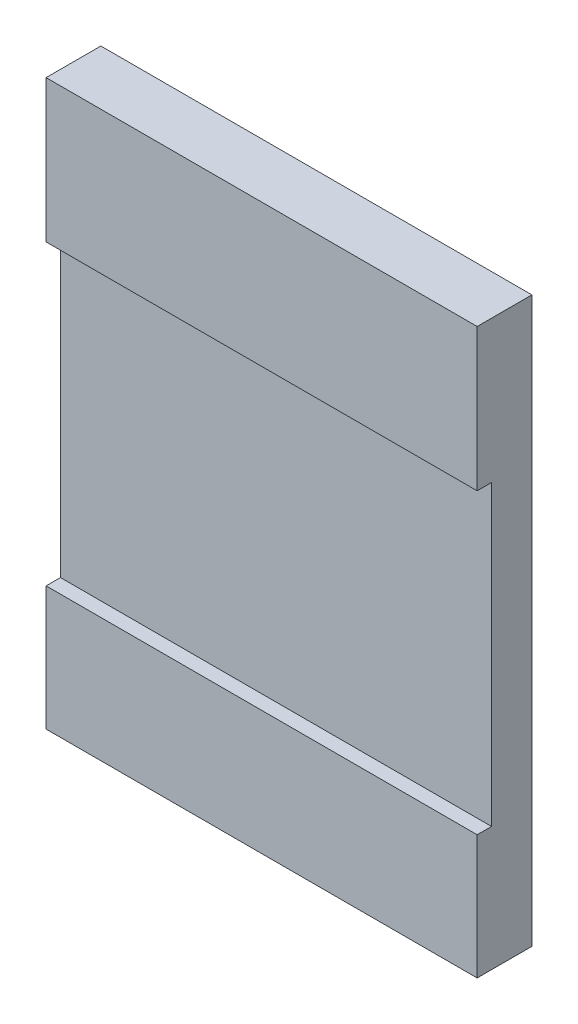
ISO-10303-21;
HEADER;
FILE_DESCRIPTION(('STEP AP214'),'2;1');
FILE_NAME('part.step','',(''),(''),'','','');
FILE_SCHEMA(('AUTOMOTIVE_DESIGN { 1 0 10303 214 1 1 1 1 }'));
ENDSEC;
DATA;
#1=APPLICATION_CONTEXT('core data for automotive mechanical design processes');
#2=APPLICATION_PROTOCOL_DEFINITION('international standard','automotive_design',2000,#1);
#3=PRODUCT_CONTEXT('',#1,'mechanical');
#4=PRODUCT('Part','Part','',(#3));
#5=PRODUCT_RELATED_PRODUCT_CATEGORY('part','',(#4));
#6=PRODUCT_DEFINITION_FORMATION('','',#4);
#7=PRODUCT_DEFINITION_CONTEXT('part definition',#1,'design');
#8=PRODUCT_DEFINITION('design','',#6,#7);
#9=PRODUCT_DEFINITION_SHAPE('','',#8);
#10=(LENGTH_UNIT() NAMED_UNIT(*) SI_UNIT(.MILLI.,.METRE.));
#11=(NAMED_UNIT(*) PLANE_ANGLE_UNIT() SI_UNIT($,.RADIAN.));
#12=(NAMED_UNIT(*) SI_UNIT($,.STERADIAN.) SOLID_ANGLE_UNIT());
#13=UNCERTAINTY_MEASURE_WITH_UNIT(LENGTH_MEASURE(1.E-05),#10,'distance_accuracy_value','');
#14=(GEOMETRIC_REPRESENTATION_CONTEXT(3) GLOBAL_UNCERTAINTY_ASSIGNED_CONTEXT((#13)) GLOBAL_UNIT_ASSIGNED_CONTEXT((#10,
#11,#12)) REPRESENTATION_CONTEXT('',''));
#15=CARTESIAN_POINT('',(0.,0.,0.));
#16=DIRECTION('',(0.,0.,1.));
#17=DIRECTION('',(1.,0.,0.));
#18=AXIS2_PLACEMENT_3D('',#15,#16,#17);
#19=CARTESIAN_POINT('',(0.,3.17500000000001,0.));
#20=DIRECTION('',(0.,0.,1.));
#21=DIRECTION('',(1.,0.,0.));
#22=AXIS2_PLACEMENT_3D('',#19,#20,#21);
#23=PLANE('',#22);
#24=DIRECTION('',(1.,0.,0.));
#25=VECTOR('',#24,1.);
#26=CARTESIAN_POINT('',(-75.001,51.8249999999998,0.));
#27=LINE('',#26,#25);
#28=CARTESIAN_POINT('',(-75.,51.8249999999998,0.));
#29=VERTEX_POINT('',#28);
#30=CARTESIAN_POINT('',(75.,51.8249999999999,0.));
#31=VERTEX_POINT('',#30);
#32=EDGE_CURVE('E109',#29,#31,#27,.T.);
#33=ORIENTED_EDGE('',*,*,#32,.T.);
#34=DIRECTION('',(0.,1.,0.));
#35=VECTOR('',#34,1.);
#36=CARTESIAN_POINT('',(75.0000000000001,3.17500000000001,0.));
#37=LINE('',#36,#35);
#38=CARTESIAN_POINT('',(75.,101.35,0.));
#39=VERTEX_POINT('',#38);
#40=EDGE_CURVE('E57',#31,#39,#37,.T.);
#41=ORIENTED_EDGE('',*,*,#40,.T.);
#42=DIRECTION('',(1.,0.,0.));
#43=VECTOR('',#42,1.);
#44=CARTESIAN_POINT('',(0.,101.35,0.));
#45=LINE('',#44,#43);
#46=CARTESIAN_POINT('',(-75.,101.35,0.));
#47=VERTEX_POINT('',#46);
#48=EDGE_CURVE('E11',#39,#47,#45,.F.);
#49=ORIENTED_EDGE('',*,*,#48,.T.);
#50=DIRECTION('',(0.,1.,0.));
#51=VECTOR('',#50,1.);
#52=CARTESIAN_POINT('',(-75.,3.17500000000001,0.));
#53=LINE('',#52,#51);
#54=EDGE_CURVE('E117',#47,#29,#53,.F.);
#55=ORIENTED_EDGE('',*,*,#54,.T.);
#56=EDGE_LOOP('',(#33,#41,#49,#55));
#57=FACE_BOUND('',#56,.T.);
#58=ADVANCED_FACE('F32',(#57),#23,.T.);
#59=CARTESIAN_POINT('',(0.,3.17500000000001,-19.05));
#60=DIRECTION('',(0.,0.,-1.));
#61=DIRECTION('',(-1.,0.,0.));
#62=AXIS2_PLACEMENT_3D('',#59,#60,#61);
#63=PLANE('',#62);
#64=DIRECTION('',(0.,1.,0.));
#65=VECTOR('',#64,1.);
#66=CARTESIAN_POINT('',(75.,101.35,-19.05));
#67=LINE('',#66,#65);
#68=CARTESIAN_POINT('',(75.0000000000001,-94.9999999999998,-19.05));
#69=VERTEX_POINT('',#68);
#70=CARTESIAN_POINT('',(75.,101.35,-19.05));
#71=VERTEX_POINT('',#70);
#72=EDGE_CURVE('E137',#69,#71,#67,.T.);
#73=ORIENTED_EDGE('',*,*,#72,.F.);
#74=DIRECTION('',(1.,0.,0.));
#75=VECTOR('',#74,1.);
#76=CARTESIAN_POINT('',(75.0000000000001,-94.9999999999998,-19.05));
#77=LINE('',#76,#75);
#78=CARTESIAN_POINT('',(-75.,-94.9999999999998,-19.05));
#79=VERTEX_POINT('',#78);
#80=EDGE_CURVE('E142',#79,#69,#77,.T.);
#81=ORIENTED_EDGE('',*,*,#80,.F.);
#82=DIRECTION('',(0.,1.,0.));
#83=VECTOR('',#82,1.);
#84=CARTESIAN_POINT('',(-75.,-94.9999999999998,-19.05));
#85=LINE('',#84,#83);
#86=CARTESIAN_POINT('',(-75.,101.35,-19.05));
#87=VERTEX_POINT('',#86);
#88=EDGE_CURVE('E36',#87,#79,#85,.F.);
#89=ORIENTED_EDGE('',*,*,#88,.F.);
#90=DIRECTION('',(1.,0.,0.));
#91=VECTOR('',#90,1.);
#92=CARTESIAN_POINT('',(-75.,101.35,-19.05));
#93=LINE('',#92,#91);
#94=EDGE_CURVE('E131',#71,#87,#93,.F.);
#95=ORIENTED_EDGE('',*,*,#94,.F.);
#96=EDGE_LOOP('',(#73,#81,#89,#95));
#97=FACE_BOUND('',#96,.T.);
#98=ADVANCED_FACE('F34',(#97),#63,.T.);
#99=CARTESIAN_POINT('',(-75.,-94.9999999999998,0.));
#100=DIRECTION('',(-1.,0.,0.));
#101=DIRECTION('',(0.,0.,1.));
#102=AXIS2_PLACEMENT_3D('',#99,#100,#101);
#103=PLANE('',#102);
#104=DIRECTION('',(0.,0.,1.));
#105=VECTOR('',#104,1.);
#106=CARTESIAN_POINT('',(-75.,51.8249999999998,0.));
#107=LINE('',#106,#105);
#108=CARTESIAN_POINT('',(-75.,51.8249999999999,-5.));
#109=VERTEX_POINT('',#108);
#110=EDGE_CURVE('E112',#109,#29,#107,.T.);
#111=ORIENTED_EDGE('',*,*,#110,.T.);
#112=ORIENTED_EDGE('',*,*,#54,.F.);
#113=DIRECTION('',(0.,0.,1.));
#114=VECTOR('',#113,1.);
#115=CARTESIAN_POINT('',(-75.,101.35,0.));
#116=LINE('',#115,#114);
#117=EDGE_CURVE('E127',#87,#47,#116,.T.);
#118=ORIENTED_EDGE('',*,*,#117,.F.);
#119=ORIENTED_EDGE('',*,*,#88,.T.);
#120=DIRECTION('',(0.,0.,-1.));
#121=VECTOR('',#120,1.);
#122=CARTESIAN_POINT('',(-75.,-94.9999999999998,0.));
#123=LINE('',#122,#121);
#124=CARTESIAN_POINT('',(-75.,-94.9999999999998,0.));
#125=VERTEX_POINT('',#124);
#126=EDGE_CURVE('E143',#125,#79,#123,.T.);
#127=ORIENTED_EDGE('',*,*,#126,.F.);
#128=CARTESIAN_POINT('',(-75.,-51.8249999999998,0.));
#129=VERTEX_POINT('',#128);
#130=EDGE_CURVE('E123',#129,#125,#53,.F.);
#131=ORIENTED_EDGE('',*,*,#130,.F.);
#132=DIRECTION('',(0.,0.,-1.));
#133=VECTOR('',#132,1.);
#134=CARTESIAN_POINT('',(-75.,-51.8249999999998,0.));
#135=LINE('',#134,#133);
#136=CARTESIAN_POINT('',(-75.,-51.8249999999998,-5.));
#137=VERTEX_POINT('',#136);
#138=EDGE_CURVE('E49',#129,#137,#135,.T.);
#139=ORIENTED_EDGE('',*,*,#138,.T.);
#140=DIRECTION('',(0.,1.,0.));
#141=VECTOR('',#140,1.);
#142=CARTESIAN_POINT('',(-75.,-51.8249999999998,-5.));
#143=LINE('',#142,#141);
#144=EDGE_CURVE('E91',#137,#109,#143,.T.);
#145=ORIENTED_EDGE('',*,*,#144,.T.);
#146=EDGE_LOOP('',(#111,#112,#118,#119,#127,#131,#139,#145));
#147=FACE_BOUND('',#146,.T.);
#148=ADVANCED_FACE('F116',(#147),#103,.T.);
#149=CARTESIAN_POINT('',(75.0000000000001,-94.9999999999998,0.));
#150=DIRECTION('',(0.,-1.,0.));
#151=DIRECTION('',(0.,0.,-1.));
#152=AXIS2_PLACEMENT_3D('',#149,#150,#151);
#153=PLANE('',#152);
#154=ORIENTED_EDGE('',*,*,#80,.T.);
#155=DIRECTION('',(0.,0.,1.));
#156=VECTOR('',#155,1.);
#157=CARTESIAN_POINT('',(75.,-94.9999999999998,0.));
#158=LINE('',#157,#156);
#159=CARTESIAN_POINT('',(75.0000000000001,-94.9999999999998,0.));
#160=VERTEX_POINT('',#159);
#161=EDGE_CURVE('E139',#160,#69,#158,.F.);
#162=ORIENTED_EDGE('',*,*,#161,.F.);
#163=DIRECTION('',(1.,0.,0.));
#164=VECTOR('',#163,1.);
#165=CARTESIAN_POINT('',(0.,-94.9999999999998,0.));
#166=LINE('',#165,#164);
#167=EDGE_CURVE('E122',#125,#160,#166,.T.);
#168=ORIENTED_EDGE('',*,*,#167,.F.);
#169=ORIENTED_EDGE('',*,*,#126,.T.);
#170=EDGE_LOOP('',(#154,#162,#168,#169));
#171=FACE_BOUND('',#170,.T.);
#172=ADVANCED_FACE('F199',(#171),#153,.T.);
#173=CARTESIAN_POINT('',(75.,101.35,0.));
#174=DIRECTION('',(1.,0.,0.));
#175=DIRECTION('',(0.,1.,0.));
#176=AXIS2_PLACEMENT_3D('',#173,#174,#175);
#177=PLANE('',#176);
#178=DIRECTION('',(0.,0.,1.));
#179=VECTOR('',#178,1.);
#180=CARTESIAN_POINT('',(75.,51.8249999999999,0.));
#181=LINE('',#180,#179);
#182=CARTESIAN_POINT('',(75.,51.8249999999999,-5.));
#183=VERTEX_POINT('',#182);
#184=EDGE_CURVE('E98',#183,#31,#181,.T.);
#185=ORIENTED_EDGE('',*,*,#184,.F.);
#186=DIRECTION('',(0.,1.,0.));
#187=VECTOR('',#186,1.);
#188=CARTESIAN_POINT('',(75.,-51.8249999999998,-5.));
#189=LINE('',#188,#187);
#190=CARTESIAN_POINT('',(75.,-51.8249999999998,-5.));
#191=VERTEX_POINT('',#190);
#192=EDGE_CURVE('E162',#191,#183,#189,.T.);
#193=ORIENTED_EDGE('',*,*,#192,.F.);
#194=DIRECTION('',(0.,0.,-1.));
#195=VECTOR('',#194,1.);
#196=CARTESIAN_POINT('',(75.,-51.8249999999998,0.));
#197=LINE('',#196,#195);
#198=CARTESIAN_POINT('',(75.,-51.8249999999998,0.));
#199=VERTEX_POINT('',#198);
#200=EDGE_CURVE('E119',#199,#191,#197,.T.);
#201=ORIENTED_EDGE('',*,*,#200,.F.);
#202=EDGE_CURVE('E41',#160,#199,#37,.T.);
#203=ORIENTED_EDGE('',*,*,#202,.F.);
#204=ORIENTED_EDGE('',*,*,#161,.T.);
#205=ORIENTED_EDGE('',*,*,#72,.T.);
#206=DIRECTION('',(0.,0.,1.));
#207=VECTOR('',#206,1.);
#208=CARTESIAN_POINT('',(75.,101.35,0.));
#209=LINE('',#208,#207);
#210=EDGE_CURVE('E134',#39,#71,#209,.F.);
#211=ORIENTED_EDGE('',*,*,#210,.F.);
#212=ORIENTED_EDGE('',*,*,#40,.F.);
#213=EDGE_LOOP('',(#185,#193,#201,#203,#204,#205,#211,#212));
#214=FACE_BOUND('',#213,.T.);
#215=ADVANCED_FACE('F158',(#214),#177,.T.);
#216=CARTESIAN_POINT('',(-75.,101.35,0.));
#217=DIRECTION('',(0.,1.,0.));
#218=DIRECTION('',(0.,0.,1.));
#219=AXIS2_PLACEMENT_3D('',#216,#217,#218);
#220=PLANE('',#219);
#221=ORIENTED_EDGE('',*,*,#94,.T.);
#222=ORIENTED_EDGE('',*,*,#117,.T.);
#223=ORIENTED_EDGE('',*,*,#48,.F.);
#224=ORIENTED_EDGE('',*,*,#210,.T.);
#225=EDGE_LOOP('',(#221,#222,#223,#224));
#226=FACE_BOUND('',#225,.T.);
#227=ADVANCED_FACE('F187',(#226),#220,.T.);
#228=DIRECTION('',(1.,0.,0.));
#229=VECTOR('',#228,1.);
#230=CARTESIAN_POINT('',(-75.001,-51.8249999999998,0.));
#231=LINE('',#230,#229);
#232=EDGE_CURVE('E150',#129,#199,#231,.T.);
#233=ORIENTED_EDGE('',*,*,#232,.F.);
#234=ORIENTED_EDGE('',*,*,#130,.T.);
#235=ORIENTED_EDGE('',*,*,#167,.T.);
#236=ORIENTED_EDGE('',*,*,#202,.T.);
#237=EDGE_LOOP('',(#233,#234,#235,#236));
#238=FACE_BOUND('',#237,.T.);
#239=ADVANCED_FACE('F155',(#238),#23,.T.);
#240=CARTESIAN_POINT('',(-75.001,51.8249999999998,0.));
#241=DIRECTION('',(0.,1.,0.));
#242=DIRECTION('',(-1.,0.,0.));
#243=AXIS2_PLACEMENT_3D('',#240,#241,#242);
#244=PLANE('',#243);
#245=DIRECTION('',(1.,0.,0.));
#246=VECTOR('',#245,1.);
#247=CARTESIAN_POINT('',(-75.001,51.8249999999998,-5.));
#248=LINE('',#247,#246);
#249=EDGE_CURVE('E114',#109,#183,#248,.T.);
#250=ORIENTED_EDGE('',*,*,#249,.T.);
#251=ORIENTED_EDGE('',*,*,#184,.T.);
#252=ORIENTED_EDGE('',*,*,#32,.F.);
#253=ORIENTED_EDGE('',*,*,#110,.F.);
#254=EDGE_LOOP('',(#250,#251,#252,#253));
#255=FACE_BOUND('',#254,.T.);
#256=ADVANCED_FACE('F111',(#255),#244,.F.);
#257=CARTESIAN_POINT('',(-75.001,-51.8249999999998,-5.));
#258=DIRECTION('',(0.,0.,-1.));
#259=DIRECTION('',(-1.,0.,0.));
#260=AXIS2_PLACEMENT_3D('',#257,#258,#259);
#261=PLANE('',#260);
#262=DIRECTION('',(1.,0.,0.));
#263=VECTOR('',#262,1.);
#264=CARTESIAN_POINT('',(-75.001,-51.8249999999998,-5.));
#265=LINE('',#264,#263);
#266=EDGE_CURVE('E168',#137,#191,#265,.T.);
#267=ORIENTED_EDGE('',*,*,#266,.T.);
#268=ORIENTED_EDGE('',*,*,#192,.T.);
#269=ORIENTED_EDGE('',*,*,#249,.F.);
#270=ORIENTED_EDGE('',*,*,#144,.F.);
#271=EDGE_LOOP('',(#267,#268,#269,#270));
#272=FACE_BOUND('',#271,.T.);
#273=ADVANCED_FACE('F171',(#272),#261,.F.);
#274=CARTESIAN_POINT('',(-75.001,-51.8249999999998,0.));
#275=DIRECTION('',(0.,-1.,0.));
#276=DIRECTION('',(1.,0.,0.));
#277=AXIS2_PLACEMENT_3D('',#274,#275,#276);
#278=PLANE('',#277);
#279=ORIENTED_EDGE('',*,*,#232,.T.);
#280=ORIENTED_EDGE('',*,*,#200,.T.);
#281=ORIENTED_EDGE('',*,*,#266,.F.);
#282=ORIENTED_EDGE('',*,*,#138,.F.);
#283=EDGE_LOOP('',(#279,#280,#281,#282));
#284=FACE_BOUND('',#283,.T.);
#285=ADVANCED_FACE('F169',(#284),#278,.F.);
#286=CLOSED_SHELL('',(#58,#98,#148,#172,#215,#227,#239,#256,#273,#285));
#287=MANIFOLD_SOLID_BREP('B2',#286);
#288=ADVANCED_BREP_SHAPE_REPRESENTATION('',(#18,#287),#14);
#289=SHAPE_DEFINITION_REPRESENTATION(#9,#288);
ENDSEC;
END-ISO-10303-21;
